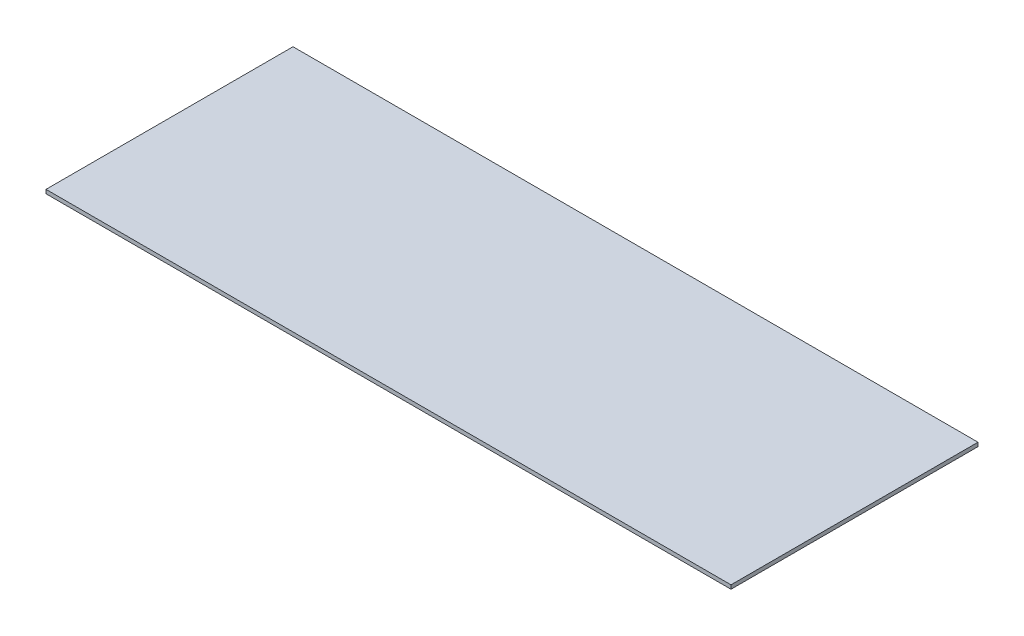
ISO-10303-21;
HEADER;
FILE_DESCRIPTION(('STEP AP214'),'2;1');
FILE_NAME('part.step','',(''),(''),'','','');
FILE_SCHEMA(('AUTOMOTIVE_DESIGN { 1 0 10303 214 1 1 1 1 }'));
ENDSEC;
DATA;
#1=APPLICATION_CONTEXT('core data for automotive mechanical design processes');
#2=APPLICATION_PROTOCOL_DEFINITION('international standard','automotive_design',2000,#1);
#3=PRODUCT_CONTEXT('',#1,'mechanical');
#4=PRODUCT('Part','Part','',(#3));
#5=PRODUCT_RELATED_PRODUCT_CATEGORY('part','',(#4));
#6=PRODUCT_DEFINITION_FORMATION('','',#4);
#7=PRODUCT_DEFINITION_CONTEXT('part definition',#1,'design');
#8=PRODUCT_DEFINITION('design','',#6,#7);
#9=PRODUCT_DEFINITION_SHAPE('','',#8);
#10=(LENGTH_UNIT() NAMED_UNIT(*) SI_UNIT(.MILLI.,.METRE.));
#11=(NAMED_UNIT(*) PLANE_ANGLE_UNIT() SI_UNIT($,.RADIAN.));
#12=(NAMED_UNIT(*) SI_UNIT($,.STERADIAN.) SOLID_ANGLE_UNIT());
#13=UNCERTAINTY_MEASURE_WITH_UNIT(LENGTH_MEASURE(1.E-05),#10,'distance_accuracy_value','');
#14=(GEOMETRIC_REPRESENTATION_CONTEXT(3) GLOBAL_UNCERTAINTY_ASSIGNED_CONTEXT((#13)) GLOBAL_UNIT_ASSIGNED_CONTEXT((#10,
#11,#12)) REPRESENTATION_CONTEXT('',''));
#15=CARTESIAN_POINT('',(0.,0.,0.));
#16=DIRECTION('',(0.,0.,1.));
#17=DIRECTION('',(1.,0.,0.));
#18=AXIS2_PLACEMENT_3D('',#15,#16,#17);
#19=CARTESIAN_POINT('',(22.185,0.25,-8.));
#20=DIRECTION('',(-1.,0.,0.));
#21=DIRECTION('',(0.,0.,1.));
#22=AXIS2_PLACEMENT_3D('',#19,#20,#21);
#23=PLANE('',#22);
#24=DIRECTION('',(0.,0.,-1.));
#25=VECTOR('',#24,1.);
#26=CARTESIAN_POINT('',(22.185,0.,-8.));
#27=LINE('',#26,#25);
#28=CARTESIAN_POINT('',(22.185,0.,8.));
#29=VERTEX_POINT('',#28);
#30=CARTESIAN_POINT('',(22.185,0.,-8.));
#31=VERTEX_POINT('',#30);
#32=EDGE_CURVE('E94',#29,#31,#27,.T.);
#33=ORIENTED_EDGE('',*,*,#32,.T.);
#34=DIRECTION('',(0.,-1.,0.));
#35=VECTOR('',#34,1.);
#36=CARTESIAN_POINT('',(22.185,0.25,-8.));
#37=LINE('',#36,#35);
#38=CARTESIAN_POINT('',(22.185,0.25,-8.));
#39=VERTEX_POINT('',#38);
#40=EDGE_CURVE('E11',#39,#31,#37,.T.);
#41=ORIENTED_EDGE('',*,*,#40,.F.);
#42=DIRECTION('',(0.,0.,-1.));
#43=VECTOR('',#42,1.);
#44=CARTESIAN_POINT('',(22.185,0.25,-8.));
#45=LINE('',#44,#43);
#46=CARTESIAN_POINT('',(22.185,0.25,8.));
#47=VERTEX_POINT('',#46);
#48=EDGE_CURVE('E82',#47,#39,#45,.T.);
#49=ORIENTED_EDGE('',*,*,#48,.F.);
#50=DIRECTION('',(0.,-1.,0.));
#51=VECTOR('',#50,1.);
#52=CARTESIAN_POINT('',(22.185,0.25,8.));
#53=LINE('',#52,#51);
#54=EDGE_CURVE('E90',#47,#29,#53,.T.);
#55=ORIENTED_EDGE('',*,*,#54,.T.);
#56=EDGE_LOOP('',(#33,#41,#49,#55));
#57=FACE_BOUND('',#56,.T.);
#58=ADVANCED_FACE('F31',(#57),#23,.F.);
#59=CARTESIAN_POINT('',(-22.185,0.25,-8.));
#60=DIRECTION('',(0.,0.,1.));
#61=DIRECTION('',(1.,0.,0.));
#62=AXIS2_PLACEMENT_3D('',#59,#60,#61);
#63=PLANE('',#62);
#64=DIRECTION('',(-1.,0.,0.));
#65=VECTOR('',#64,1.);
#66=CARTESIAN_POINT('',(-22.185,0.,-8.));
#67=LINE('',#66,#65);
#68=CARTESIAN_POINT('',(-22.185,0.,-8.));
#69=VERTEX_POINT('',#68);
#70=EDGE_CURVE('E86',#31,#69,#67,.T.);
#71=ORIENTED_EDGE('',*,*,#70,.T.);
#72=DIRECTION('',(0.,-1.,0.));
#73=VECTOR('',#72,1.);
#74=CARTESIAN_POINT('',(-22.185,0.25,-8.));
#75=LINE('',#74,#73);
#76=CARTESIAN_POINT('',(-22.185,0.25,-8.));
#77=VERTEX_POINT('',#76);
#78=EDGE_CURVE('E39',#77,#69,#75,.T.);
#79=ORIENTED_EDGE('',*,*,#78,.F.);
#80=DIRECTION('',(-1.,0.,0.));
#81=VECTOR('',#80,1.);
#82=CARTESIAN_POINT('',(-22.185,0.25,-8.));
#83=LINE('',#82,#81);
#84=EDGE_CURVE('E77',#39,#77,#83,.T.);
#85=ORIENTED_EDGE('',*,*,#84,.F.);
#86=ORIENTED_EDGE('',*,*,#40,.T.);
#87=EDGE_LOOP('',(#71,#79,#85,#86));
#88=FACE_BOUND('',#87,.T.);
#89=ADVANCED_FACE('F85',(#88),#63,.F.);
#90=CARTESIAN_POINT('',(-22.185,0.25,-8.));
#91=DIRECTION('',(1.,0.,0.));
#92=DIRECTION('',(0.,0.,-1.));
#93=AXIS2_PLACEMENT_3D('',#90,#91,#92);
#94=PLANE('',#93);
#95=DIRECTION('',(0.,0.,1.));
#96=VECTOR('',#95,1.);
#97=CARTESIAN_POINT('',(-22.185,0.,-8.));
#98=LINE('',#97,#96);
#99=CARTESIAN_POINT('',(-22.185,0.,8.));
#100=VERTEX_POINT('',#99);
#101=EDGE_CURVE('E64',#69,#100,#98,.T.);
#102=ORIENTED_EDGE('',*,*,#101,.T.);
#103=DIRECTION('',(0.,-1.,0.));
#104=VECTOR('',#103,1.);
#105=CARTESIAN_POINT('',(-22.185,0.25,8.));
#106=LINE('',#105,#104);
#107=CARTESIAN_POINT('',(-22.185,0.25,8.));
#108=VERTEX_POINT('',#107);
#109=EDGE_CURVE('E87',#108,#100,#106,.T.);
#110=ORIENTED_EDGE('',*,*,#109,.F.);
#111=DIRECTION('',(0.,0.,1.));
#112=VECTOR('',#111,1.);
#113=CARTESIAN_POINT('',(-22.185,0.25,-8.));
#114=LINE('',#113,#112);
#115=EDGE_CURVE('E80',#77,#108,#114,.T.);
#116=ORIENTED_EDGE('',*,*,#115,.F.);
#117=ORIENTED_EDGE('',*,*,#78,.T.);
#118=EDGE_LOOP('',(#102,#110,#116,#117));
#119=FACE_BOUND('',#118,.T.);
#120=ADVANCED_FACE('F88',(#119),#94,.F.);
#121=CARTESIAN_POINT('',(-22.185,0.25,8.));
#122=DIRECTION('',(0.,0.,-1.));
#123=DIRECTION('',(-1.,0.,0.));
#124=AXIS2_PLACEMENT_3D('',#121,#122,#123);
#125=PLANE('',#124);
#126=DIRECTION('',(1.,0.,0.));
#127=VECTOR('',#126,1.);
#128=CARTESIAN_POINT('',(-22.185,0.,8.));
#129=LINE('',#128,#127);
#130=EDGE_CURVE('E70',#100,#29,#129,.T.);
#131=ORIENTED_EDGE('',*,*,#130,.T.);
#132=ORIENTED_EDGE('',*,*,#54,.F.);
#133=DIRECTION('',(1.,0.,0.));
#134=VECTOR('',#133,1.);
#135=CARTESIAN_POINT('',(-22.185,0.25,8.));
#136=LINE('',#135,#134);
#137=EDGE_CURVE('E47',#108,#47,#136,.T.);
#138=ORIENTED_EDGE('',*,*,#137,.F.);
#139=ORIENTED_EDGE('',*,*,#109,.T.);
#140=EDGE_LOOP('',(#131,#132,#138,#139));
#141=FACE_BOUND('',#140,.T.);
#142=ADVANCED_FACE('F101',(#141),#125,.F.);
#143=CARTESIAN_POINT('',(22.185,0.25,8.));
#144=DIRECTION('',(0.,1.,0.));
#145=DIRECTION('',(0.,0.,1.));
#146=AXIS2_PLACEMENT_3D('',#143,#144,#145);
#147=PLANE('',#146);
#148=ORIENTED_EDGE('',*,*,#48,.T.);
#149=ORIENTED_EDGE('',*,*,#84,.T.);
#150=ORIENTED_EDGE('',*,*,#115,.T.);
#151=ORIENTED_EDGE('',*,*,#137,.T.);
#152=EDGE_LOOP('',(#148,#149,#150,#151));
#153=FACE_BOUND('',#152,.T.);
#154=ADVANCED_FACE('F78',(#153),#147,.T.);
#155=CARTESIAN_POINT('',(22.185,0.,8.));
#156=DIRECTION('',(0.,1.,0.));
#157=DIRECTION('',(0.,0.,1.));
#158=AXIS2_PLACEMENT_3D('',#155,#156,#157);
#159=PLANE('',#158);
#160=ORIENTED_EDGE('',*,*,#32,.F.);
#161=ORIENTED_EDGE('',*,*,#130,.F.);
#162=ORIENTED_EDGE('',*,*,#101,.F.);
#163=ORIENTED_EDGE('',*,*,#70,.F.);
#164=EDGE_LOOP('',(#160,#161,#162,#163));
#165=FACE_BOUND('',#164,.T.);
#166=ADVANCED_FACE('F104',(#165),#159,.F.);
#167=CLOSED_SHELL('',(#58,#89,#120,#142,#154,#166));
#168=MANIFOLD_SOLID_BREP('B2',#167);
#169=ADVANCED_BREP_SHAPE_REPRESENTATION('',(#18,#168),#14);
#170=SHAPE_DEFINITION_REPRESENTATION(#9,#169);
ENDSEC;
END-ISO-10303-21;
